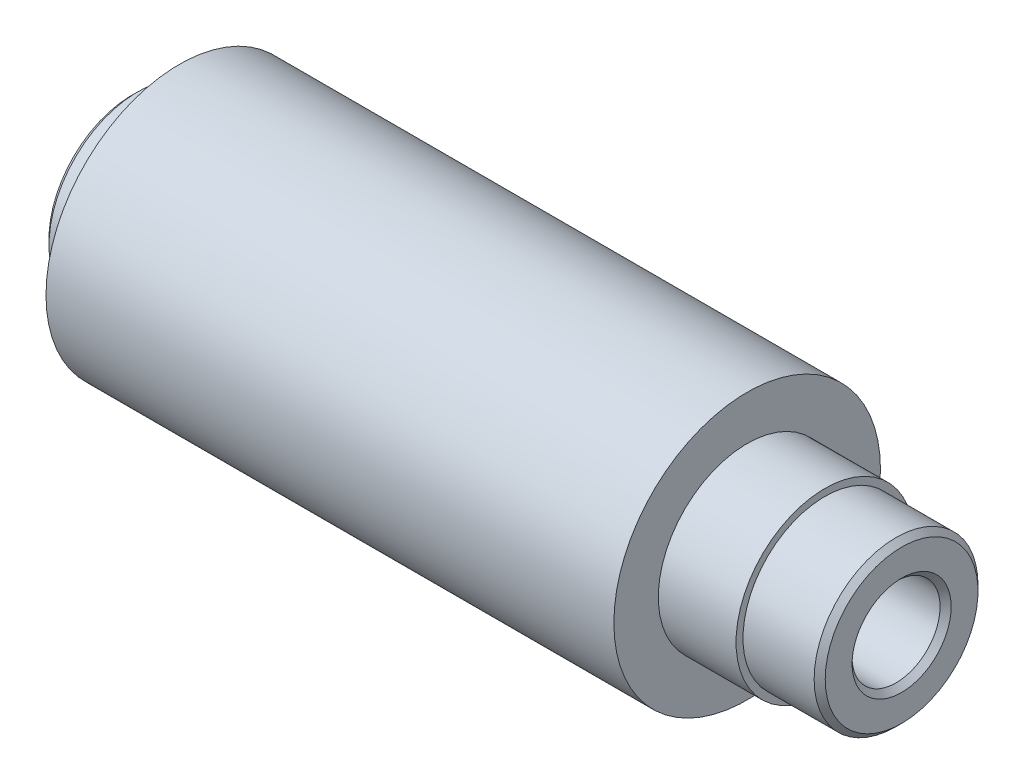
ISO-10303-21;
HEADER;
FILE_DESCRIPTION(('STEP AP214'),'2;1');
FILE_NAME('part.step','',(''),(''),'','','');
FILE_SCHEMA(('AUTOMOTIVE_DESIGN { 1 0 10303 214 1 1 1 1 }'));
ENDSEC;
DATA;
#1=APPLICATION_CONTEXT('core data for automotive mechanical design processes');
#2=APPLICATION_PROTOCOL_DEFINITION('international standard','automotive_design',2000,#1);
#3=PRODUCT_CONTEXT('',#1,'mechanical');
#4=PRODUCT('Part','Part','',(#3));
#5=PRODUCT_RELATED_PRODUCT_CATEGORY('part','',(#4));
#6=PRODUCT_DEFINITION_FORMATION('','',#4);
#7=PRODUCT_DEFINITION_CONTEXT('part definition',#1,'design');
#8=PRODUCT_DEFINITION('design','',#6,#7);
#9=PRODUCT_DEFINITION_SHAPE('','',#8);
#10=(LENGTH_UNIT() NAMED_UNIT(*) SI_UNIT(.MILLI.,.METRE.));
#11=(NAMED_UNIT(*) PLANE_ANGLE_UNIT() SI_UNIT($,.RADIAN.));
#12=(NAMED_UNIT(*) SI_UNIT($,.STERADIAN.) SOLID_ANGLE_UNIT());
#13=UNCERTAINTY_MEASURE_WITH_UNIT(LENGTH_MEASURE(1.E-05),#10,'distance_accuracy_value','');
#14=(GEOMETRIC_REPRESENTATION_CONTEXT(3) GLOBAL_UNCERTAINTY_ASSIGNED_CONTEXT((#13)) GLOBAL_UNIT_ASSIGNED_CONTEXT((#10,
#11,#12)) REPRESENTATION_CONTEXT('',''));
#15=CARTESIAN_POINT('',(0.,0.,0.));
#16=DIRECTION('',(0.,0.,1.));
#17=DIRECTION('',(1.,0.,0.));
#18=AXIS2_PLACEMENT_3D('',#15,#16,#17);
#19=CARTESIAN_POINT('',(109.9820000004,0.,0.));
#20=DIRECTION('',(1.,0.,0.));
#21=DIRECTION('',(0.,0.,-1.));
#22=AXIS2_PLACEMENT_3D('',#19,#20,#21);
#23=CONICAL_SURFACE('',#22,7.07897999961915,0.785398162500842);
#24=CARTESIAN_POINT('',(109.9820000004,0.,0.));
#25=DIRECTION('',(1.,0.,0.));
#26=DIRECTION('',(0.,0.,-1.));
#27=AXIS2_PLACEMENT_3D('',#24,#25,#26);
#28=CIRCLE('',#27,7.07897999961915);
#29=CARTESIAN_POINT('',(109.9820000004,0.,-7.07897999961915));
#30=VERTEX_POINT('',#29);
#31=EDGE_CURVE('E18',#30,#30,#28,.F.);
#32=ORIENTED_EDGE('',*,*,#31,.F.);
#33=EDGE_LOOP('',(#32));
#34=FACE_BOUND('',#33,.T.);
#35=CARTESIAN_POINT('',(109.18952,0.,0.));
#36=DIRECTION('',(1.,0.,0.));
#37=DIRECTION('',(0.,0.,-1.));
#38=AXIS2_PLACEMENT_3D('',#35,#36,#37);
#39=CIRCLE('',#38,6.28650000000005);
#40=CARTESIAN_POINT('',(109.18952,0.,-6.28650000000005));
#41=VERTEX_POINT('',#40);
#42=EDGE_CURVE('E54',#41,#41,#39,.F.);
#43=ORIENTED_EDGE('',*,*,#42,.T.);
#44=EDGE_LOOP('',(#43));
#45=FACE_BOUND('',#44,.T.);
#46=ADVANCED_FACE('F15',(#34,#45),#23,.F.);
#47=CARTESIAN_POINT('',(109.982,8.99795000000003,0.));
#48=DIRECTION('',(1.,0.,0.));
#49=DIRECTION('',(0.,0.,-1.));
#50=AXIS2_PLACEMENT_3D('',#47,#48,#49);
#51=PLANE('',#50);
#52=ORIENTED_EDGE('',*,*,#31,.T.);
#53=EDGE_LOOP('',(#52));
#54=FACE_BOUND('',#53,.T.);
#55=CARTESIAN_POINT('',(109.982000000356,0.,0.));
#56=DIRECTION('',(-1.,0.,0.));
#57=DIRECTION('',(0.,0.,1.));
#58=AXIS2_PLACEMENT_3D('',#55,#56,#57);
#59=CIRCLE('',#58,10.9169200003556);
#60=CARTESIAN_POINT('',(109.982000000356,0.,10.9169200003556));
#61=VERTEX_POINT('',#60);
#62=EDGE_CURVE('E51',#61,#61,#59,.T.);
#63=ORIENTED_EDGE('',*,*,#62,.F.);
#64=EDGE_LOOP('',(#63));
#65=FACE_BOUND('',#64,.T.);
#66=ADVANCED_FACE('F196',(#54,#65),#51,.T.);
#67=CARTESIAN_POINT('',(54.9910000000001,0.,0.));
#68=DIRECTION('',(1.,0.,0.));
#69=DIRECTION('',(0.,0.,-1.));
#70=AXIS2_PLACEMENT_3D('',#67,#68,#69);
#71=CYLINDRICAL_SURFACE('',#70,6.28650000000005);
#72=ORIENTED_EDGE('',*,*,#42,.F.);
#73=EDGE_LOOP('',(#72));
#74=FACE_BOUND('',#73,.T.);
#75=CARTESIAN_POINT('',(0.792480000370688,0.,0.));
#76=DIRECTION('',(-1.,0.,0.));
#77=DIRECTION('',(0.,1.,0.));
#78=AXIS2_PLACEMENT_3D('',#75,#76,#77);
#79=CIRCLE('',#78,6.28650000038533);
#80=CARTESIAN_POINT('',(0.792480000370688,6.28650000038533,0.));
#81=VERTEX_POINT('',#80);
#82=EDGE_CURVE('E53',#81,#81,#79,.T.);
#83=ORIENTED_EDGE('',*,*,#82,.T.);
#84=EDGE_LOOP('',(#83));
#85=FACE_BOUND('',#84,.T.);
#86=ADVANCED_FACE('F187',(#74,#85),#71,.F.);
#87=CARTESIAN_POINT('',(109.189519999645,0.,0.));
#88=DIRECTION('',(-1.,0.,0.));
#89=DIRECTION('',(0.,0.,1.));
#90=AXIS2_PLACEMENT_3D('',#87,#88,#89);
#91=CONICAL_SURFACE('',#90,11.7093999996444,0.785398162500001);
#92=CARTESIAN_POINT('',(109.18952,0.,0.));
#93=DIRECTION('',(1.,0.,0.));
#94=DIRECTION('',(0.,0.,-1.));
#95=AXIS2_PLACEMENT_3D('',#92,#93,#94);
#96=CIRCLE('',#95,11.7094);
#97=CARTESIAN_POINT('',(109.18952,0.,-11.7094));
#98=VERTEX_POINT('',#97);
#99=EDGE_CURVE('E50',#98,#98,#96,.F.);
#100=ORIENTED_EDGE('',*,*,#99,.F.);
#101=EDGE_LOOP('',(#100));
#102=FACE_BOUND('',#101,.T.);
#103=ORIENTED_EDGE('',*,*,#62,.T.);
#104=EDGE_LOOP('',(#103));
#105=FACE_BOUND('',#104,.T.);
#106=ADVANCED_FACE('F178',(#102,#105),#91,.T.);
#107=CARTESIAN_POINT('',(-2.8421709430404E-10,0.,0.));
#108=DIRECTION('',(-1.,0.,0.));
#109=DIRECTION('',(0.,0.,1.));
#110=AXIS2_PLACEMENT_3D('',#107,#108,#109);
#111=CONICAL_SURFACE('',#110,7.07897999956231,0.785398162500842);
#112=ORIENTED_EDGE('',*,*,#82,.F.);
#113=EDGE_LOOP('',(#112));
#114=FACE_BOUND('',#113,.T.);
#115=CARTESIAN_POINT('',(-3.41060513164848E-10,0.,0.));
#116=DIRECTION('',(-1.,0.,0.));
#117=DIRECTION('',(0.,0.,1.));
#118=AXIS2_PLACEMENT_3D('',#115,#116,#117);
#119=CIRCLE('',#118,7.07897999961915);
#120=CARTESIAN_POINT('',(-3.41060513164848E-10,0.,7.07897999961915));
#121=VERTEX_POINT('',#120);
#122=EDGE_CURVE('E48',#121,#121,#119,.F.);
#123=ORIENTED_EDGE('',*,*,#122,.F.);
#124=EDGE_LOOP('',(#123));
#125=FACE_BOUND('',#124,.T.);
#126=ADVANCED_FACE('F169',(#114,#125),#111,.F.);
#127=CARTESIAN_POINT('',(104.10571,0.,0.));
#128=DIRECTION('',(1.,0.,0.));
#129=DIRECTION('',(0.,0.,-1.));
#130=AXIS2_PLACEMENT_3D('',#127,#128,#129);
#131=CYLINDRICAL_SURFACE('',#130,11.7094);
#132=CARTESIAN_POINT('',(99.0219000000001,0.,0.));
#133=DIRECTION('',(1.,0.,0.));
#134=DIRECTION('',(0.,0.,-1.));
#135=AXIS2_PLACEMENT_3D('',#132,#133,#134);
#136=CIRCLE('',#135,11.7094);
#137=CARTESIAN_POINT('',(99.0219000000001,0.,-11.7094));
#138=VERTEX_POINT('',#137);
#139=EDGE_CURVE('E45',#138,#138,#136,.F.);
#140=ORIENTED_EDGE('',*,*,#139,.F.);
#141=EDGE_LOOP('',(#140));
#142=FACE_BOUND('',#141,.T.);
#143=ORIENTED_EDGE('',*,*,#99,.T.);
#144=EDGE_LOOP('',(#143));
#145=FACE_BOUND('',#144,.T.);
#146=ADVANCED_FACE('F160',(#142,#145),#131,.T.);
#147=CARTESIAN_POINT('',(0.,9.47420000000005,0.));
#148=DIRECTION('',(-1.,0.,0.));
#149=DIRECTION('',(0.,0.,1.));
#150=AXIS2_PLACEMENT_3D('',#147,#148,#149);
#151=PLANE('',#150);
#152=ORIENTED_EDGE('',*,*,#122,.T.);
#153=EDGE_LOOP('',(#152));
#154=FACE_BOUND('',#153,.T.);
#155=CARTESIAN_POINT('',(-3.556035674257E-10,0.,0.));
#156=DIRECTION('',(1.,0.,0.));
#157=DIRECTION('',(0.,0.,-1.));
#158=AXIS2_PLACEMENT_3D('',#155,#156,#157);
#159=CIRCLE('',#158,11.8694200003557);
#160=CARTESIAN_POINT('',(-3.5560351660848E-10,0.,-11.8694200003557));
#161=VERTEX_POINT('',#160);
#162=EDGE_CURVE('E42',#161,#161,#159,.T.);
#163=ORIENTED_EDGE('',*,*,#162,.F.);
#164=EDGE_LOOP('',(#163));
#165=FACE_BOUND('',#164,.T.);
#166=ADVANCED_FACE('F91',(#154,#165),#151,.T.);
#167=CARTESIAN_POINT('',(99.0219000000001,12.2047,0.));
#168=DIRECTION('',(1.,0.,0.));
#169=DIRECTION('',(0.,0.,-1.));
#170=AXIS2_PLACEMENT_3D('',#167,#168,#169);
#171=PLANE('',#170);
#172=ORIENTED_EDGE('',*,*,#139,.T.);
#173=EDGE_LOOP('',(#172));
#174=FACE_BOUND('',#173,.T.);
#175=CARTESIAN_POINT('',(99.0219000000001,0.,0.));
#176=DIRECTION('',(1.,0.,0.));
#177=DIRECTION('',(0.,0.,-1.));
#178=AXIS2_PLACEMENT_3D('',#175,#176,#177);
#179=CIRCLE('',#178,12.7);
#180=CARTESIAN_POINT('',(99.0219000000001,0.,-12.7));
#181=VERTEX_POINT('',#180);
#182=EDGE_CURVE('E39',#181,#181,#179,.F.);
#183=ORIENTED_EDGE('',*,*,#182,.F.);
#184=EDGE_LOOP('',(#183));
#185=FACE_BOUND('',#184,.T.);
#186=ADVANCED_FACE('F81',(#174,#185),#171,.T.);
#187=CARTESIAN_POINT('',(0.792480000355605,0.,0.));
#188=DIRECTION('',(1.,0.,0.));
#189=DIRECTION('',(0.,0.,-1.));
#190=AXIS2_PLACEMENT_3D('',#187,#188,#189);
#191=CONICAL_SURFACE('',#190,12.6618999996444,0.7853981625);
#192=ORIENTED_EDGE('',*,*,#162,.T.);
#193=EDGE_LOOP('',(#192));
#194=FACE_BOUND('',#193,.T.);
#195=CARTESIAN_POINT('',(0.79248,0.,0.));
#196=DIRECTION('',(1.,0.,0.));
#197=DIRECTION('',(0.,0.,-1.));
#198=AXIS2_PLACEMENT_3D('',#195,#196,#197);
#199=CIRCLE('',#198,12.6619);
#200=CARTESIAN_POINT('',(0.79248,0.,-12.6619));
#201=VERTEX_POINT('',#200);
#202=EDGE_CURVE('E38',#201,#201,#199,.T.);
#203=ORIENTED_EDGE('',*,*,#202,.F.);
#204=EDGE_LOOP('',(#203));
#205=FACE_BOUND('',#204,.T.);
#206=ADVANCED_FACE('F78',(#194,#205),#191,.T.);
#207=CARTESIAN_POINT('',(93.4656500000002,0.,0.));
#208=DIRECTION('',(1.,0.,0.));
#209=DIRECTION('',(0.,0.,-1.));
#210=AXIS2_PLACEMENT_3D('',#207,#208,#209);
#211=CYLINDRICAL_SURFACE('',#210,12.7);
#212=CARTESIAN_POINT('',(87.9094000000002,0.,0.));
#213=DIRECTION('',(1.,0.,0.));
#214=DIRECTION('',(0.,0.,-1.));
#215=AXIS2_PLACEMENT_3D('',#212,#213,#214);
#216=CIRCLE('',#215,12.7);
#217=CARTESIAN_POINT('',(87.9094000000002,0.,-12.7));
#218=VERTEX_POINT('',#217);
#219=EDGE_CURVE('E35',#218,#218,#216,.F.);
#220=ORIENTED_EDGE('',*,*,#219,.F.);
#221=EDGE_LOOP('',(#220));
#222=FACE_BOUND('',#221,.T.);
#223=ORIENTED_EDGE('',*,*,#182,.T.);
#224=EDGE_LOOP('',(#223));
#225=FACE_BOUND('',#224,.T.);
#226=ADVANCED_FACE('F80',(#222,#225),#211,.T.);
#227=CARTESIAN_POINT('',(3.77444000000003,0.,0.));
#228=DIRECTION('',(1.,0.,0.));
#229=DIRECTION('',(0.,0.,-1.));
#230=AXIS2_PLACEMENT_3D('',#227,#228,#229);
#231=CYLINDRICAL_SURFACE('',#230,12.6619);
#232=ORIENTED_EDGE('',*,*,#202,.T.);
#233=EDGE_LOOP('',(#232));
#234=FACE_BOUND('',#233,.T.);
#235=CARTESIAN_POINT('',(6.75640000000005,0.,0.));
#236=DIRECTION('',(1.,0.,0.));
#237=DIRECTION('',(0.,0.,-1.));
#238=AXIS2_PLACEMENT_3D('',#235,#236,#237);
#239=CIRCLE('',#238,12.6619);
#240=CARTESIAN_POINT('',(6.75640000000005,0.,-12.6619));
#241=VERTEX_POINT('',#240);
#242=EDGE_CURVE('E27',#241,#241,#239,.T.);
#243=ORIENTED_EDGE('',*,*,#242,.F.);
#244=EDGE_LOOP('',(#243));
#245=FACE_BOUND('',#244,.T.);
#246=ADVANCED_FACE('F75',(#234,#245),#231,.T.);
#247=CARTESIAN_POINT('',(87.9094000000002,15.875,0.));
#248=DIRECTION('',(1.,0.,0.));
#249=DIRECTION('',(0.,0.,-1.));
#250=AXIS2_PLACEMENT_3D('',#247,#248,#249);
#251=PLANE('',#250);
#252=ORIENTED_EDGE('',*,*,#219,.T.);
#253=EDGE_LOOP('',(#252));
#254=FACE_BOUND('',#253,.T.);
#255=CARTESIAN_POINT('',(87.9094000000002,0.,0.));
#256=DIRECTION('',(1.,0.,0.));
#257=DIRECTION('',(0.,0.,-1.));
#258=AXIS2_PLACEMENT_3D('',#255,#256,#257);
#259=CIRCLE('',#258,19.05);
#260=CARTESIAN_POINT('',(87.9094000000002,0.,-19.05));
#261=VERTEX_POINT('',#260);
#262=EDGE_CURVE('E22',#261,#261,#259,.F.);
#263=ORIENTED_EDGE('',*,*,#262,.F.);
#264=EDGE_LOOP('',(#263));
#265=FACE_BOUND('',#264,.T.);
#266=ADVANCED_FACE('F101',(#254,#265),#251,.T.);
#267=CARTESIAN_POINT('',(6.75640000000005,15.85595,0.));
#268=DIRECTION('',(-1.,0.,0.));
#269=DIRECTION('',(0.,0.,1.));
#270=AXIS2_PLACEMENT_3D('',#267,#268,#269);
#271=PLANE('',#270);
#272=ORIENTED_EDGE('',*,*,#242,.T.);
#273=EDGE_LOOP('',(#272));
#274=FACE_BOUND('',#273,.T.);
#275=CARTESIAN_POINT('',(6.75640000000005,0.,0.));
#276=DIRECTION('',(1.,0.,0.));
#277=DIRECTION('',(0.,0.,-1.));
#278=AXIS2_PLACEMENT_3D('',#275,#276,#277);
#279=CIRCLE('',#278,19.05);
#280=CARTESIAN_POINT('',(6.75640000000005,0.,-19.05));
#281=VERTEX_POINT('',#280);
#282=EDGE_CURVE('E10',#281,#281,#279,.T.);
#283=ORIENTED_EDGE('',*,*,#282,.F.);
#284=EDGE_LOOP('',(#283));
#285=FACE_BOUND('',#284,.T.);
#286=ADVANCED_FACE('F96',(#274,#285),#271,.T.);
#287=CARTESIAN_POINT('',(47.3329000000001,0.,0.));
#288=DIRECTION('',(1.,0.,0.));
#289=DIRECTION('',(0.,0.,-1.));
#290=AXIS2_PLACEMENT_3D('',#287,#288,#289);
#291=CYLINDRICAL_SURFACE('',#290,19.05);
#292=ORIENTED_EDGE('',*,*,#282,.T.);
#293=EDGE_LOOP('',(#292));
#294=FACE_BOUND('',#293,.T.);
#295=ORIENTED_EDGE('',*,*,#262,.T.);
#296=EDGE_LOOP('',(#295));
#297=FACE_BOUND('',#296,.T.);
#298=ADVANCED_FACE('F94',(#294,#297),#291,.T.);
#299=CLOSED_SHELL('',(#46,#66,#86,#106,#126,#146,#166,#186,#206,#226,#246,#266,#286,#298));
#300=MANIFOLD_SOLID_BREP('B1',#299);
#301=ADVANCED_BREP_SHAPE_REPRESENTATION('',(#18,#300),#14);
#302=SHAPE_DEFINITION_REPRESENTATION(#9,#301);
ENDSEC;
END-ISO-10303-21;
